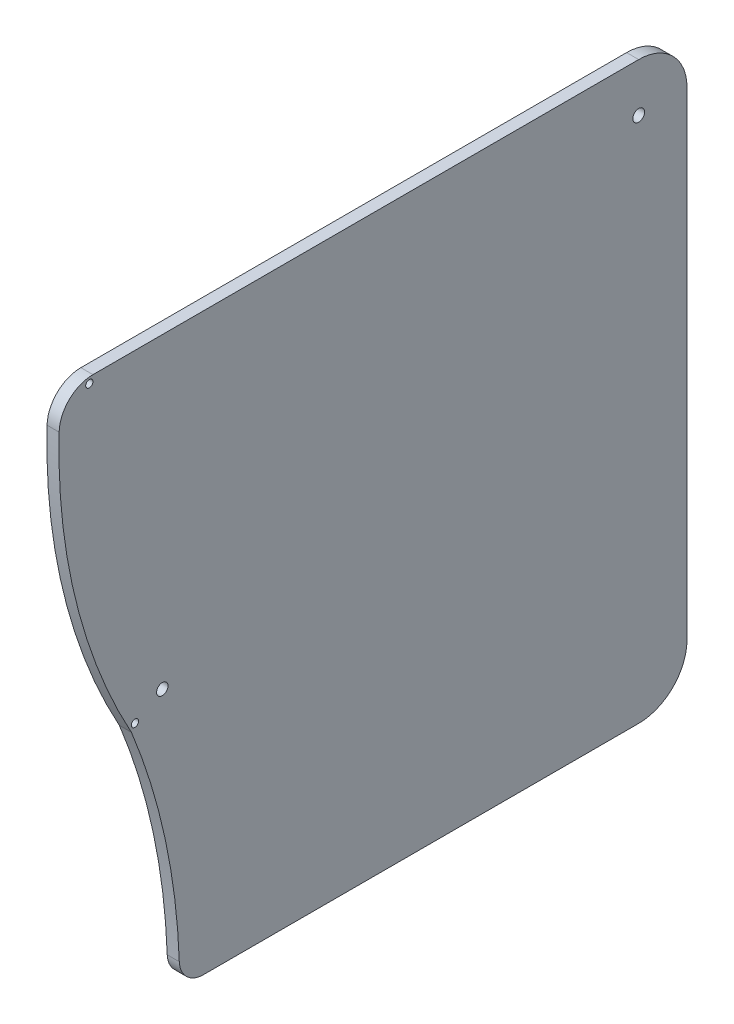
ISO-10303-21;
HEADER;
FILE_DESCRIPTION(('STEP AP214'),'2;1');
FILE_NAME('part.step','',(''),(''),'','','');
FILE_SCHEMA(('AUTOMOTIVE_DESIGN { 1 0 10303 214 1 1 1 1 }'));
ENDSEC;
DATA;
#1=APPLICATION_CONTEXT('core data for automotive mechanical design processes');
#2=APPLICATION_PROTOCOL_DEFINITION('international standard','automotive_design',2000,#1);
#3=PRODUCT_CONTEXT('',#1,'mechanical');
#4=PRODUCT('Part','Part','',(#3));
#5=PRODUCT_RELATED_PRODUCT_CATEGORY('part','',(#4));
#6=PRODUCT_DEFINITION_FORMATION('','',#4);
#7=PRODUCT_DEFINITION_CONTEXT('part definition',#1,'design');
#8=PRODUCT_DEFINITION('design','',#6,#7);
#9=PRODUCT_DEFINITION_SHAPE('','',#8);
#10=(LENGTH_UNIT() NAMED_UNIT(*) SI_UNIT(.MILLI.,.METRE.));
#11=(NAMED_UNIT(*) PLANE_ANGLE_UNIT() SI_UNIT($,.RADIAN.));
#12=(NAMED_UNIT(*) SI_UNIT($,.STERADIAN.) SOLID_ANGLE_UNIT());
#13=UNCERTAINTY_MEASURE_WITH_UNIT(LENGTH_MEASURE(1.E-05),#10,'distance_accuracy_value','');
#14=(GEOMETRIC_REPRESENTATION_CONTEXT(3) GLOBAL_UNCERTAINTY_ASSIGNED_CONTEXT((#13)) GLOBAL_UNIT_ASSIGNED_CONTEXT((#10,
#11,#12)) REPRESENTATION_CONTEXT('',''));
#15=CARTESIAN_POINT('',(0.,0.,0.));
#16=DIRECTION('',(0.,0.,1.));
#17=DIRECTION('',(1.,0.,0.));
#18=AXIS2_PLACEMENT_3D('',#15,#16,#17);
#19=CARTESIAN_POINT('',(3.175,0.,0.));
#20=DIRECTION('',(1.,0.,0.));
#21=DIRECTION('',(0.,0.,-1.));
#22=AXIS2_PLACEMENT_3D('',#19,#20,#21);
#23=PLANE('',#22);
#24=CARTESIAN_POINT('',(3.175,73.9775,74.5619158638602));
#25=DIRECTION('',(1.,0.,0.));
#26=DIRECTION('',(0.,0.,-1.));
#27=AXIS2_PLACEMENT_3D('',#24,#25,#26);
#28=CIRCLE('',#27,0.952499999999996);
#29=CARTESIAN_POINT('',(3.175,73.9775,73.6094158638602));
#30=VERTEX_POINT('',#29);
#31=EDGE_CURVE('E220',#30,#30,#28,.T.);
#32=ORIENTED_EDGE('',*,*,#31,.F.);
#33=EDGE_LOOP('',(#32));
#34=FACE_BOUND('',#33,.T.);
#35=CARTESIAN_POINT('',(3.175,-9.31335011248837,62.5720645796578));
#36=DIRECTION('',(1.,0.,0.));
#37=DIRECTION('',(0.,0.,-1.));
#38=AXIS2_PLACEMENT_3D('',#35,#36,#37);
#39=CIRCLE('',#38,0.952499999999996);
#40=CARTESIAN_POINT('',(3.175,-9.31335011248837,61.6195645796578));
#41=VERTEX_POINT('',#40);
#42=EDGE_CURVE('E214',#41,#41,#39,.T.);
#43=ORIENTED_EDGE('',*,*,#42,.F.);
#44=EDGE_LOOP('',(#43));
#45=FACE_BOUND('',#44,.T.);
#46=CARTESIAN_POINT('',(3.175,-5.13500000000001,55.3787906194099));
#47=DIRECTION('',(1.,0.,0.));
#48=DIRECTION('',(0.,0.,-1.));
#49=AXIS2_PLACEMENT_3D('',#46,#47,#48);
#50=CIRCLE('',#49,1.5);
#51=CARTESIAN_POINT('',(3.175,-5.13500000000001,53.8787906194099));
#52=VERTEX_POINT('',#51);
#53=EDGE_CURVE('E206',#52,#52,#50,.T.);
#54=ORIENTED_EDGE('',*,*,#53,.F.);
#55=EDGE_LOOP('',(#54));
#56=FACE_BOUND('',#55,.T.);
#57=CARTESIAN_POINT('',(3.175,62.865,-69.85));
#58=DIRECTION('',(1.,0.,0.));
#59=DIRECTION('',(0.,0.,-1.));
#60=AXIS2_PLACEMENT_3D('',#57,#58,#59);
#61=CIRCLE('',#60,1.54999999999999);
#62=CARTESIAN_POINT('',(3.175,62.865,-71.4));
#63=VERTEX_POINT('',#62);
#64=EDGE_CURVE('E153',#63,#63,#61,.T.);
#65=ORIENTED_EDGE('',*,*,#64,.F.);
#66=EDGE_LOOP('',(#65));
#67=FACE_BOUND('',#66,.T.);
#68=CARTESIAN_POINT('',(3.175,-75.565,221.70037307676));
#69=DIRECTION('',(1.,0.,0.));
#70=DIRECTION('',(0.,0.,-1.));
#71=AXIS2_PLACEMENT_3D('',#68,#69,#70);
#72=CIRCLE('',#71,170.90037307676);
#73=CARTESIAN_POINT('',(3.175,-69.4424889429008,50.909704783286));
#74=VERTEX_POINT('',#73);
#75=CARTESIAN_POINT('',(3.175,-10.9153327452514,63.5));
#76=VERTEX_POINT('',#75);
#77=EDGE_CURVE('E136',#74,#76,#72,.T.);
#78=ORIENTED_EDGE('',*,*,#77,.F.);
#79=CARTESIAN_POINT('',(3.175,-69.215,44.5637809907355));
#80=DIRECTION('',(1.,0.,0.));
#81=DIRECTION('',(0.,0.,-1.));
#82=AXIS2_PLACEMENT_3D('',#79,#80,#81);
#83=CIRCLE('',#82,6.35);
#84=CARTESIAN_POINT('',(3.175,-75.565,44.5637809907355));
#85=VERTEX_POINT('',#84);
#86=EDGE_CURVE('E78',#74,#85,#83,.T.);
#87=ORIENTED_EDGE('',*,*,#86,.T.);
#88=DIRECTION('',(0.,0.,-1.));
#89=VECTOR('',#88,1.);
#90=CARTESIAN_POINT('',(3.175,-75.565,0.));
#91=LINE('',#90,#89);
#92=CARTESIAN_POINT('',(3.175,-75.565,-69.8500000000001));
#93=VERTEX_POINT('',#92);
#94=EDGE_CURVE('E162',#85,#93,#91,.T.);
#95=ORIENTED_EDGE('',*,*,#94,.T.);
#96=CARTESIAN_POINT('',(3.175,-62.865,-69.8500000000001));
#97=DIRECTION('',(1.,0.,0.));
#98=DIRECTION('',(0.,0.,-1.));
#99=AXIS2_PLACEMENT_3D('',#96,#97,#98);
#100=CIRCLE('',#99,12.7);
#101=CARTESIAN_POINT('',(3.175,-62.865,-82.55));
#102=VERTEX_POINT('',#101);
#103=EDGE_CURVE('E164',#93,#102,#100,.T.);
#104=ORIENTED_EDGE('',*,*,#103,.T.);
#105=DIRECTION('',(0.,-1.,0.));
#106=VECTOR('',#105,1.);
#107=CARTESIAN_POINT('',(3.175,0.,-82.55));
#108=LINE('',#107,#106);
#109=CARTESIAN_POINT('',(3.175,62.865,-82.55));
#110=VERTEX_POINT('',#109);
#111=EDGE_CURVE('E166',#110,#102,#108,.T.);
#112=ORIENTED_EDGE('',*,*,#111,.F.);
#113=CARTESIAN_POINT('',(3.175,62.865,-69.85));
#114=DIRECTION('',(1.,0.,0.));
#115=DIRECTION('',(0.,0.,-1.));
#116=AXIS2_PLACEMENT_3D('',#113,#114,#115);
#117=CIRCLE('',#116,12.7);
#118=CARTESIAN_POINT('',(3.175,75.565,-69.85));
#119=VERTEX_POINT('',#118);
#120=EDGE_CURVE('E156',#110,#119,#117,.T.);
#121=ORIENTED_EDGE('',*,*,#120,.T.);
#122=DIRECTION('',(0.,0.,-1.));
#123=VECTOR('',#122,1.);
#124=CARTESIAN_POINT('',(3.175,75.565,0.));
#125=LINE('',#124,#123);
#126=CARTESIAN_POINT('',(3.175,75.565,73.6094158638603));
#127=VERTEX_POINT('',#126);
#128=EDGE_CURVE('E160',#127,#119,#125,.T.);
#129=ORIENTED_EDGE('',*,*,#128,.F.);
#130=CARTESIAN_POINT('',(3.175,66.675,73.6094158638603));
#131=DIRECTION('',(1.,0.,0.));
#132=DIRECTION('',(0.,0.,-1.));
#133=AXIS2_PLACEMENT_3D('',#130,#131,#132);
#134=CIRCLE('',#133,8.89);
#135=CARTESIAN_POINT('',(3.175,66.911017699115,82.496282333303));
#136=VERTEX_POINT('',#135);
#137=EDGE_CURVE('E196',#127,#136,#134,.T.);
#138=ORIENTED_EDGE('',*,*,#137,.T.);
#139=CARTESIAN_POINT('',(3.175,62.865,-69.85));
#140=DIRECTION('',(1.,0.,0.));
#141=DIRECTION('',(0.,0.,-1.));
#142=AXIS2_PLACEMENT_3D('',#139,#140,#141);
#143=CIRCLE('',#142,152.4);
#144=EDGE_CURVE('E145',#136,#76,#143,.T.);
#145=ORIENTED_EDGE('',*,*,#144,.T.);
#146=EDGE_LOOP('',(#78,#87,#95,#104,#112,#121,#129,#138,#145));
#147=FACE_BOUND('',#146,.T.);
#148=ADVANCED_FACE('F56',(#34,#45,#56,#67,#147),#23,.T.);
#149=CARTESIAN_POINT('',(0.,0.,0.));
#150=DIRECTION('',(1.,0.,0.));
#151=DIRECTION('',(0.,0.,-1.));
#152=AXIS2_PLACEMENT_3D('',#149,#150,#151);
#153=PLANE('',#152);
#154=CARTESIAN_POINT('',(0.,73.9775,74.5619158638602));
#155=DIRECTION('',(1.,0.,0.));
#156=DIRECTION('',(0.,0.,-1.));
#157=AXIS2_PLACEMENT_3D('',#154,#155,#156);
#158=CIRCLE('',#157,0.952499999999996);
#159=CARTESIAN_POINT('',(0.,73.9775,73.6094158638602));
#160=VERTEX_POINT('',#159);
#161=EDGE_CURVE('E211',#160,#160,#158,.T.);
#162=ORIENTED_EDGE('',*,*,#161,.T.);
#163=EDGE_LOOP('',(#162));
#164=FACE_BOUND('',#163,.T.);
#165=CARTESIAN_POINT('',(0.,-9.31335011248837,62.5720645796578));
#166=DIRECTION('',(1.,0.,0.));
#167=DIRECTION('',(0.,0.,-1.));
#168=AXIS2_PLACEMENT_3D('',#165,#166,#167);
#169=CIRCLE('',#168,0.952499999999996);
#170=CARTESIAN_POINT('',(0.,-9.31335011248837,61.6195645796578));
#171=VERTEX_POINT('',#170);
#172=EDGE_CURVE('E217',#171,#171,#169,.T.);
#173=ORIENTED_EDGE('',*,*,#172,.T.);
#174=EDGE_LOOP('',(#173));
#175=FACE_BOUND('',#174,.T.);
#176=CARTESIAN_POINT('',(0.,-5.13500000000001,55.3787906194099));
#177=DIRECTION('',(1.,0.,0.));
#178=DIRECTION('',(0.,0.,-1.));
#179=AXIS2_PLACEMENT_3D('',#176,#177,#178);
#180=CIRCLE('',#179,1.5);
#181=CARTESIAN_POINT('',(0.,-5.13500000000001,53.8787906194099));
#182=VERTEX_POINT('',#181);
#183=EDGE_CURVE('E204',#182,#182,#180,.T.);
#184=ORIENTED_EDGE('',*,*,#183,.T.);
#185=EDGE_LOOP('',(#184));
#186=FACE_BOUND('',#185,.T.);
#187=CARTESIAN_POINT('',(0.,62.865,-69.85));
#188=DIRECTION('',(1.,0.,0.));
#189=DIRECTION('',(0.,0.,-1.));
#190=AXIS2_PLACEMENT_3D('',#187,#188,#189);
#191=CIRCLE('',#190,1.54999999999999);
#192=CARTESIAN_POINT('',(0.,62.865,-71.4));
#193=VERTEX_POINT('',#192);
#194=EDGE_CURVE('E144',#193,#193,#191,.T.);
#195=ORIENTED_EDGE('',*,*,#194,.T.);
#196=EDGE_LOOP('',(#195));
#197=FACE_BOUND('',#196,.T.);
#198=DIRECTION('',(0.,0.,-1.));
#199=VECTOR('',#198,1.);
#200=CARTESIAN_POINT('',(0.,-75.565,0.));
#201=LINE('',#200,#199);
#202=CARTESIAN_POINT('',(0.,-75.565,44.5637809907355));
#203=VERTEX_POINT('',#202);
#204=CARTESIAN_POINT('',(0.,-75.565,-69.8500000000001));
#205=VERTEX_POINT('',#204);
#206=EDGE_CURVE('E177',#203,#205,#201,.T.);
#207=ORIENTED_EDGE('',*,*,#206,.F.);
#208=CARTESIAN_POINT('',(0.,-69.215,44.5637809907355));
#209=DIRECTION('',(1.,0.,0.));
#210=DIRECTION('',(0.,0.,-1.));
#211=AXIS2_PLACEMENT_3D('',#208,#209,#210);
#212=CIRCLE('',#211,6.35);
#213=CARTESIAN_POINT('',(0.,-69.4424889429008,50.909704783286));
#214=VERTEX_POINT('',#213);
#215=EDGE_CURVE('E12',#203,#214,#212,.F.);
#216=ORIENTED_EDGE('',*,*,#215,.T.);
#217=CARTESIAN_POINT('',(0.,-75.565,221.70037307676));
#218=DIRECTION('',(1.,0.,0.));
#219=DIRECTION('',(0.,0.,-1.));
#220=AXIS2_PLACEMENT_3D('',#217,#218,#219);
#221=CIRCLE('',#220,170.90037307676);
#222=CARTESIAN_POINT('',(0.,-10.9153327452514,63.5));
#223=VERTEX_POINT('',#222);
#224=EDGE_CURVE('E125',#214,#223,#221,.T.);
#225=ORIENTED_EDGE('',*,*,#224,.T.);
#226=CARTESIAN_POINT('',(0.,62.865,-69.85));
#227=DIRECTION('',(1.,0.,0.));
#228=DIRECTION('',(0.,0.,-1.));
#229=AXIS2_PLACEMENT_3D('',#226,#227,#228);
#230=CIRCLE('',#229,152.4);
#231=CARTESIAN_POINT('',(0.,66.911017699115,82.496282333303));
#232=VERTEX_POINT('',#231);
#233=EDGE_CURVE('E128',#232,#223,#230,.T.);
#234=ORIENTED_EDGE('',*,*,#233,.F.);
#235=CARTESIAN_POINT('',(0.,66.675,73.6094158638603));
#236=DIRECTION('',(1.,0.,0.));
#237=DIRECTION('',(0.,0.,-1.));
#238=AXIS2_PLACEMENT_3D('',#235,#236,#237);
#239=CIRCLE('',#238,8.89);
#240=CARTESIAN_POINT('',(0.,75.565,73.6094158638603));
#241=VERTEX_POINT('',#240);
#242=EDGE_CURVE('E199',#232,#241,#239,.F.);
#243=ORIENTED_EDGE('',*,*,#242,.T.);
#244=DIRECTION('',(0.,0.,-1.));
#245=VECTOR('',#244,1.);
#246=CARTESIAN_POINT('',(0.,75.565,0.));
#247=LINE('',#246,#245);
#248=CARTESIAN_POINT('',(0.,75.565,-69.85));
#249=VERTEX_POINT('',#248);
#250=EDGE_CURVE('E175',#241,#249,#247,.T.);
#251=ORIENTED_EDGE('',*,*,#250,.T.);
#252=CARTESIAN_POINT('',(0.,62.865,-69.85));
#253=DIRECTION('',(1.,0.,0.));
#254=DIRECTION('',(0.,0.,-1.));
#255=AXIS2_PLACEMENT_3D('',#252,#253,#254);
#256=CIRCLE('',#255,12.7);
#257=CARTESIAN_POINT('',(0.,62.865,-82.55));
#258=VERTEX_POINT('',#257);
#259=EDGE_CURVE('E172',#258,#249,#256,.T.);
#260=ORIENTED_EDGE('',*,*,#259,.F.);
#261=DIRECTION('',(0.,-1.,0.));
#262=VECTOR('',#261,1.);
#263=CARTESIAN_POINT('',(0.,0.,-82.55));
#264=LINE('',#263,#262);
#265=CARTESIAN_POINT('',(0.,-62.865,-82.55));
#266=VERTEX_POINT('',#265);
#267=EDGE_CURVE('E157',#258,#266,#264,.T.);
#268=ORIENTED_EDGE('',*,*,#267,.T.);
#269=CARTESIAN_POINT('',(0.,-62.865,-69.8500000000001));
#270=DIRECTION('',(1.,0.,0.));
#271=DIRECTION('',(0.,0.,-1.));
#272=AXIS2_PLACEMENT_3D('',#269,#270,#271);
#273=CIRCLE('',#272,12.7);
#274=EDGE_CURVE('E179',#205,#266,#273,.T.);
#275=ORIENTED_EDGE('',*,*,#274,.F.);
#276=EDGE_LOOP('',(#207,#216,#225,#234,#243,#251,#260,#268,#275));
#277=FACE_BOUND('',#276,.T.);
#278=ADVANCED_FACE('F127',(#164,#175,#186,#197,#277),#153,.F.);
#279=CARTESIAN_POINT('',(3.175,75.565,0.));
#280=DIRECTION('',(0.,1.,0.));
#281=DIRECTION('',(0.,0.,1.));
#282=AXIS2_PLACEMENT_3D('',#279,#280,#281);
#283=PLANE('',#282);
#284=ORIENTED_EDGE('',*,*,#250,.F.);
#285=DIRECTION('',(1.,0.,0.));
#286=VECTOR('',#285,1.);
#287=CARTESIAN_POINT('',(3.175,75.565,73.6094158638603));
#288=LINE('',#287,#286);
#289=EDGE_CURVE('E193',#241,#127,#288,.T.);
#290=ORIENTED_EDGE('',*,*,#289,.T.);
#291=ORIENTED_EDGE('',*,*,#128,.T.);
#292=DIRECTION('',(-1.,0.,0.));
#293=VECTOR('',#292,1.);
#294=CARTESIAN_POINT('',(3.175,75.565,-69.85));
#295=LINE('',#294,#293);
#296=EDGE_CURVE('E190',#119,#249,#295,.T.);
#297=ORIENTED_EDGE('',*,*,#296,.T.);
#298=EDGE_LOOP('',(#284,#290,#291,#297));
#299=FACE_BOUND('',#298,.T.);
#300=ADVANCED_FACE('F253',(#299),#283,.T.);
#301=CARTESIAN_POINT('',(3.175,62.865,-69.85));
#302=DIRECTION('',(-1.,0.,0.));
#303=DIRECTION('',(0.,0.,1.));
#304=AXIS2_PLACEMENT_3D('',#301,#302,#303);
#305=CYLINDRICAL_SURFACE('',#304,12.7);
#306=ORIENTED_EDGE('',*,*,#259,.T.);
#307=ORIENTED_EDGE('',*,*,#296,.F.);
#308=ORIENTED_EDGE('',*,*,#120,.F.);
#309=DIRECTION('',(-1.,0.,0.));
#310=VECTOR('',#309,1.);
#311=CARTESIAN_POINT('',(3.175,62.865,-82.55));
#312=LINE('',#311,#310);
#313=EDGE_CURVE('E169',#110,#258,#312,.T.);
#314=ORIENTED_EDGE('',*,*,#313,.T.);
#315=EDGE_LOOP('',(#306,#307,#308,#314));
#316=FACE_BOUND('',#315,.T.);
#317=ADVANCED_FACE('F258',(#316),#305,.T.);
#318=CARTESIAN_POINT('',(3.175,-75.565,0.));
#319=DIRECTION('',(0.,1.,0.));
#320=DIRECTION('',(0.,0.,1.));
#321=AXIS2_PLACEMENT_3D('',#318,#319,#320);
#322=PLANE('',#321);
#323=ORIENTED_EDGE('',*,*,#94,.F.);
#324=DIRECTION('',(1.,0.,0.));
#325=VECTOR('',#324,1.);
#326=CARTESIAN_POINT('',(3.175,-75.565,44.5637809907355));
#327=LINE('',#326,#325);
#328=EDGE_CURVE('E64',#85,#203,#327,.F.);
#329=ORIENTED_EDGE('',*,*,#328,.T.);
#330=ORIENTED_EDGE('',*,*,#206,.T.);
#331=DIRECTION('',(-1.,0.,0.));
#332=VECTOR('',#331,1.);
#333=CARTESIAN_POINT('',(3.175,-75.565,-69.8500000000001));
#334=LINE('',#333,#332);
#335=EDGE_CURVE('E187',#93,#205,#334,.T.);
#336=ORIENTED_EDGE('',*,*,#335,.F.);
#337=EDGE_LOOP('',(#323,#329,#330,#336));
#338=FACE_BOUND('',#337,.T.);
#339=ADVANCED_FACE('F268',(#338),#322,.F.);
#340=CARTESIAN_POINT('',(3.175,-62.865,-69.8500000000001));
#341=DIRECTION('',(-1.,0.,0.));
#342=DIRECTION('',(0.,0.,1.));
#343=AXIS2_PLACEMENT_3D('',#340,#341,#342);
#344=CYLINDRICAL_SURFACE('',#343,12.7);
#345=ORIENTED_EDGE('',*,*,#274,.T.);
#346=DIRECTION('',(-1.,0.,0.));
#347=VECTOR('',#346,1.);
#348=CARTESIAN_POINT('',(3.175,-62.865,-82.55));
#349=LINE('',#348,#347);
#350=EDGE_CURVE('E185',#102,#266,#349,.T.);
#351=ORIENTED_EDGE('',*,*,#350,.F.);
#352=ORIENTED_EDGE('',*,*,#103,.F.);
#353=ORIENTED_EDGE('',*,*,#335,.T.);
#354=EDGE_LOOP('',(#345,#351,#352,#353));
#355=FACE_BOUND('',#354,.T.);
#356=ADVANCED_FACE('F248',(#355),#344,.T.);
#357=CARTESIAN_POINT('',(3.175,62.865,-69.85));
#358=DIRECTION('',(-1.,0.,0.));
#359=DIRECTION('',(0.,0.,1.));
#360=AXIS2_PLACEMENT_3D('',#357,#358,#359);
#361=CYLINDRICAL_SURFACE('',#360,1.54999999999999);
#362=ORIENTED_EDGE('',*,*,#64,.T.);
#363=EDGE_LOOP('',(#362));
#364=FACE_BOUND('',#363,.T.);
#365=ORIENTED_EDGE('',*,*,#194,.F.);
#366=EDGE_LOOP('',(#365));
#367=FACE_BOUND('',#366,.T.);
#368=ADVANCED_FACE('F244',(#364,#367),#361,.F.);
#369=CARTESIAN_POINT('',(3.175,0.,-82.55));
#370=DIRECTION('',(0.,0.,-1.));
#371=DIRECTION('',(-1.,0.,0.));
#372=AXIS2_PLACEMENT_3D('',#369,#370,#371);
#373=PLANE('',#372);
#374=ORIENTED_EDGE('',*,*,#267,.F.);
#375=ORIENTED_EDGE('',*,*,#313,.F.);
#376=ORIENTED_EDGE('',*,*,#111,.T.);
#377=ORIENTED_EDGE('',*,*,#350,.T.);
#378=EDGE_LOOP('',(#374,#375,#376,#377));
#379=FACE_BOUND('',#378,.T.);
#380=ADVANCED_FACE('F247',(#379),#373,.T.);
#381=CARTESIAN_POINT('',(0.,62.865,-69.85));
#382=DIRECTION('',(1.,0.,0.));
#383=DIRECTION('',(0.,0.,-1.));
#384=AXIS2_PLACEMENT_3D('',#381,#382,#383);
#385=CYLINDRICAL_SURFACE('',#384,152.4);
#386=ORIENTED_EDGE('',*,*,#144,.F.);
#387=DIRECTION('',(1.,0.,0.));
#388=VECTOR('',#387,1.);
#389=CARTESIAN_POINT('',(0.,66.911017699115,82.496282333303));
#390=LINE('',#389,#388);
#391=EDGE_CURVE('E143',#136,#232,#390,.F.);
#392=ORIENTED_EDGE('',*,*,#391,.T.);
#393=ORIENTED_EDGE('',*,*,#233,.T.);
#394=DIRECTION('',(1.,0.,0.));
#395=VECTOR('',#394,1.);
#396=CARTESIAN_POINT('',(0.,-10.9153327452514,63.5));
#397=LINE('',#396,#395);
#398=EDGE_CURVE('E135',#223,#76,#397,.T.);
#399=ORIENTED_EDGE('',*,*,#398,.T.);
#400=EDGE_LOOP('',(#386,#392,#393,#399));
#401=FACE_BOUND('',#400,.T.);
#402=ADVANCED_FACE('F141',(#401),#385,.T.);
#403=CARTESIAN_POINT('',(0.,-75.565,221.70037307676));
#404=DIRECTION('',(1.,0.,0.));
#405=DIRECTION('',(0.,0.,-1.));
#406=AXIS2_PLACEMENT_3D('',#403,#404,#405);
#407=CYLINDRICAL_SURFACE('',#406,170.90037307676);
#408=ORIENTED_EDGE('',*,*,#224,.F.);
#409=DIRECTION('',(1.,0.,0.));
#410=VECTOR('',#409,1.);
#411=CARTESIAN_POINT('',(0.,-69.4424889429008,50.909704783286));
#412=LINE('',#411,#410);
#413=EDGE_CURVE('E201',#214,#74,#412,.T.);
#414=ORIENTED_EDGE('',*,*,#413,.T.);
#415=ORIENTED_EDGE('',*,*,#77,.T.);
#416=ORIENTED_EDGE('',*,*,#398,.F.);
#417=EDGE_LOOP('',(#408,#414,#415,#416));
#418=FACE_BOUND('',#417,.T.);
#419=ADVANCED_FACE('F147',(#418),#407,.F.);
#420=CARTESIAN_POINT('',(0.,66.675,73.6094158638603));
#421=DIRECTION('',(1.,0.,0.));
#422=DIRECTION('',(0.,0.,-1.));
#423=AXIS2_PLACEMENT_3D('',#420,#421,#422);
#424=CYLINDRICAL_SURFACE('',#423,8.89);
#425=ORIENTED_EDGE('',*,*,#242,.F.);
#426=ORIENTED_EDGE('',*,*,#391,.F.);
#427=ORIENTED_EDGE('',*,*,#137,.F.);
#428=ORIENTED_EDGE('',*,*,#289,.F.);
#429=EDGE_LOOP('',(#425,#426,#427,#428));
#430=FACE_BOUND('',#429,.T.);
#431=ADVANCED_FACE('F274',(#430),#424,.T.);
#432=CARTESIAN_POINT('',(0.,-5.13500000000001,55.3787906194099));
#433=DIRECTION('',(1.,0.,0.));
#434=DIRECTION('',(0.,0.,-1.));
#435=AXIS2_PLACEMENT_3D('',#432,#433,#434);
#436=CYLINDRICAL_SURFACE('',#435,1.5);
#437=ORIENTED_EDGE('',*,*,#183,.F.);
#438=EDGE_LOOP('',(#437));
#439=FACE_BOUND('',#438,.T.);
#440=ORIENTED_EDGE('',*,*,#53,.T.);
#441=EDGE_LOOP('',(#440));
#442=FACE_BOUND('',#441,.T.);
#443=ADVANCED_FACE('F276',(#439,#442),#436,.F.);
#444=CARTESIAN_POINT('',(0.,-9.31335011248837,62.5720645796578));
#445=DIRECTION('',(1.,0.,0.));
#446=DIRECTION('',(0.,0.,-1.));
#447=AXIS2_PLACEMENT_3D('',#444,#445,#446);
#448=CYLINDRICAL_SURFACE('',#447,0.952499999999996);
#449=ORIENTED_EDGE('',*,*,#172,.F.);
#450=EDGE_LOOP('',(#449));
#451=FACE_BOUND('',#450,.T.);
#452=ORIENTED_EDGE('',*,*,#42,.T.);
#453=EDGE_LOOP('',(#452));
#454=FACE_BOUND('',#453,.T.);
#455=ADVANCED_FACE('F231',(#451,#454),#448,.F.);
#456=CARTESIAN_POINT('',(0.,73.9775,74.5619158638602));
#457=DIRECTION('',(1.,0.,0.));
#458=DIRECTION('',(0.,0.,-1.));
#459=AXIS2_PLACEMENT_3D('',#456,#457,#458);
#460=CYLINDRICAL_SURFACE('',#459,0.952499999999996);
#461=ORIENTED_EDGE('',*,*,#161,.F.);
#462=EDGE_LOOP('',(#461));
#463=FACE_BOUND('',#462,.T.);
#464=ORIENTED_EDGE('',*,*,#31,.T.);
#465=EDGE_LOOP('',(#464));
#466=FACE_BOUND('',#465,.T.);
#467=ADVANCED_FACE('F228',(#463,#466),#460,.F.);
#468=CARTESIAN_POINT('',(0.,-69.215,44.5637809907355));
#469=DIRECTION('',(1.,0.,0.));
#470=DIRECTION('',(0.,0.,-1.));
#471=AXIS2_PLACEMENT_3D('',#468,#469,#470);
#472=CYLINDRICAL_SURFACE('',#471,6.35);
#473=ORIENTED_EDGE('',*,*,#215,.F.);
#474=ORIENTED_EDGE('',*,*,#328,.F.);
#475=ORIENTED_EDGE('',*,*,#86,.F.);
#476=ORIENTED_EDGE('',*,*,#413,.F.);
#477=EDGE_LOOP('',(#473,#474,#475,#476));
#478=FACE_BOUND('',#477,.T.);
#479=ADVANCED_FACE('F58',(#478),#472,.T.);
#480=CLOSED_SHELL('',(#148,#278,#300,#317,#339,#356,#368,#380,#402,#419,#431,#443,#455,#467,#479));
#481=MANIFOLD_SOLID_BREP('B2',#480);
#482=ADVANCED_BREP_SHAPE_REPRESENTATION('',(#18,#481),#14);
#483=SHAPE_DEFINITION_REPRESENTATION(#9,#482);
ENDSEC;
END-ISO-10303-21;
